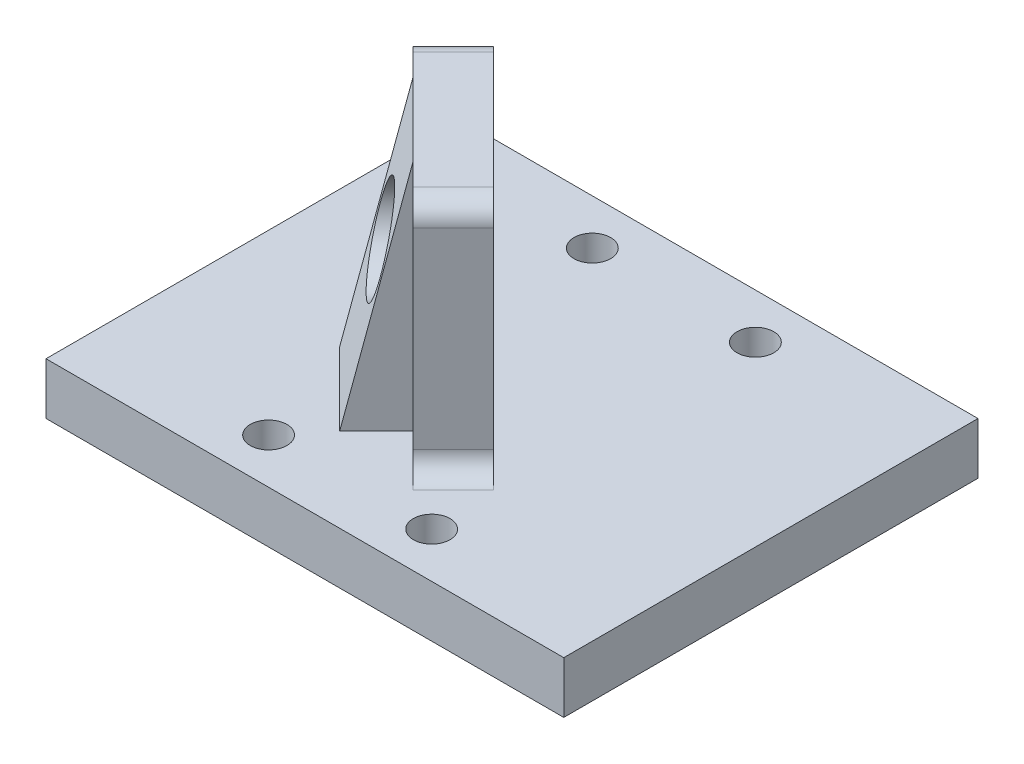
ISO-10303-21;
HEADER;
FILE_DESCRIPTION(('STEP AP214'),'2;1');
FILE_NAME('part.step','',(''),(''),'','','');
FILE_SCHEMA(('AUTOMOTIVE_DESIGN { 1 0 10303 214 1 1 1 1 }'));
ENDSEC;
DATA;
#1=APPLICATION_CONTEXT('core data for automotive mechanical design processes');
#2=APPLICATION_PROTOCOL_DEFINITION('international standard','automotive_design',2000,#1);
#3=PRODUCT_CONTEXT('',#1,'mechanical');
#4=PRODUCT('Part','Part','',(#3));
#5=PRODUCT_RELATED_PRODUCT_CATEGORY('part','',(#4));
#6=PRODUCT_DEFINITION_FORMATION('','',#4);
#7=PRODUCT_DEFINITION_CONTEXT('part definition',#1,'design');
#8=PRODUCT_DEFINITION('design','',#6,#7);
#9=PRODUCT_DEFINITION_SHAPE('','',#8);
#10=(LENGTH_UNIT() NAMED_UNIT(*) SI_UNIT(.MILLI.,.METRE.));
#11=(NAMED_UNIT(*) PLANE_ANGLE_UNIT() SI_UNIT($,.RADIAN.));
#12=(NAMED_UNIT(*) SI_UNIT($,.STERADIAN.) SOLID_ANGLE_UNIT());
#13=UNCERTAINTY_MEASURE_WITH_UNIT(LENGTH_MEASURE(1.E-05),#10,'distance_accuracy_value','');
#14=(GEOMETRIC_REPRESENTATION_CONTEXT(3) GLOBAL_UNCERTAINTY_ASSIGNED_CONTEXT((#13)) GLOBAL_UNIT_ASSIGNED_CONTEXT((#10,
#11,#12)) REPRESENTATION_CONTEXT('',''));
#15=CARTESIAN_POINT('',(0.,0.,0.));
#16=DIRECTION('',(0.,0.,1.));
#17=DIRECTION('',(1.,0.,0.));
#18=AXIS2_PLACEMENT_3D('',#15,#16,#17);
#19=CARTESIAN_POINT('',(2.90796857661204,34.925,15.0525436655256));
#20=DIRECTION('',(0.707106781186549,0.,-0.707106781186546));
#21=DIRECTION('',(-0.707106781186546,0.,-0.707106781186549));
#22=AXIS2_PLACEMENT_3D('',#19,#20,#21);
#23=PLANE('',#22);
#24=DIRECTION('',(0.,-1.,0.));
#25=VECTOR('',#24,1.);
#26=CARTESIAN_POINT('',(-1.58215948392223,6.35,10.5624156049914));
#27=LINE('',#26,#25);
#28=CARTESIAN_POINT('',(-1.58215948392223,34.925,10.5624156049914));
#29=VERTEX_POINT('',#28);
#30=CARTESIAN_POINT('',(-1.58215948392223,6.35,10.5624156049914));
#31=VERTEX_POINT('',#30);
#32=EDGE_CURVE('E52',#29,#31,#27,.T.);
#33=ORIENTED_EDGE('',*,*,#32,.T.);
#34=DIRECTION('',(0.707106781186546,0.,0.707106781186549));
#35=VECTOR('',#34,1.);
#36=CARTESIAN_POINT('',(2.90796857661204,6.35,15.0525436655256));
#37=LINE('',#36,#35);
#38=CARTESIAN_POINT('',(4.70401980082587,6.35,16.8485948897395));
#39=VERTEX_POINT('',#38);
#40=EDGE_CURVE('E171',#31,#39,#37,.T.);
#41=ORIENTED_EDGE('',*,*,#40,.T.);
#42=CARTESIAN_POINT('',(4.70401980082587,8.89,16.8485948897395));
#43=DIRECTION('',(0.707106781186549,0.,-0.707106781186546));
#44=DIRECTION('',(-0.707106781186546,0.,-0.707106781186549));
#45=AXIS2_PLACEMENT_3D('',#42,#43,#44);
#46=CIRCLE('',#45,2.54);
#47=CARTESIAN_POINT('',(2.90796857661204,8.89,15.0525436655256));
#48=VERTEX_POINT('',#47);
#49=EDGE_CURVE('E11',#39,#48,#46,.T.);
#50=ORIENTED_EDGE('',*,*,#49,.T.);
#51=DIRECTION('',(0.,-1.,0.));
#52=VECTOR('',#51,1.);
#53=CARTESIAN_POINT('',(2.90796857661204,34.925,15.0525436655256));
#54=LINE('',#53,#52);
#55=CARTESIAN_POINT('',(2.90796857661204,32.385,15.0525436655256));
#56=VERTEX_POINT('',#55);
#57=EDGE_CURVE('E180',#56,#48,#54,.T.);
#58=ORIENTED_EDGE('',*,*,#57,.F.);
#59=CARTESIAN_POINT('',(1.11191735239821,32.385,13.2564924413118));
#60=DIRECTION('',(0.707106781186549,0.,-0.707106781186546));
#61=DIRECTION('',(-0.707106781186546,0.,-0.707106781186549));
#62=AXIS2_PLACEMENT_3D('',#59,#60,#61);
#63=CIRCLE('',#62,2.54);
#64=CARTESIAN_POINT('',(1.11191735239821,34.925,13.2564924413118));
#65=VERTEX_POINT('',#64);
#66=EDGE_CURVE('E238',#56,#65,#63,.F.);
#67=ORIENTED_EDGE('',*,*,#66,.T.);
#68=DIRECTION('',(0.707106781186546,0.,0.707106781186549));
#69=VECTOR('',#68,1.);
#70=CARTESIAN_POINT('',(2.90796857661204,34.925,15.0525436655256));
#71=LINE('',#70,#69);
#72=EDGE_CURVE('E174',#29,#65,#71,.T.);
#73=ORIENTED_EDGE('',*,*,#72,.F.);
#74=EDGE_LOOP('',(#33,#41,#50,#58,#67,#73));
#75=FACE_BOUND('',#74,.T.);
#76=ADVANCED_FACE('F35',(#75),#23,.F.);
#77=CARTESIAN_POINT('',(0.,6.35,0.));
#78=DIRECTION('',(0.,-1.,0.));
#79=DIRECTION('',(0.,0.,-1.));
#80=AXIS2_PLACEMENT_3D('',#77,#78,#79);
#81=PLANE('',#80);
#82=CARTESIAN_POINT('',(-10.,6.35,19.85));
#83=DIRECTION('',(0.,1.,0.));
#84=DIRECTION('',(0.,0.,1.));
#85=AXIS2_PLACEMENT_3D('',#82,#83,#84);
#86=CIRCLE('',#85,2.25);
#87=CARTESIAN_POINT('',(-10.,6.35,22.1));
#88=VERTEX_POINT('',#87);
#89=EDGE_CURVE('E279',#88,#88,#86,.T.);
#90=ORIENTED_EDGE('',*,*,#89,.F.);
#91=EDGE_LOOP('',(#90));
#92=FACE_BOUND('',#91,.T.);
#93=CARTESIAN_POINT('',(-10.,6.35,-19.85));
#94=DIRECTION('',(0.,1.,0.));
#95=DIRECTION('',(0.,0.,1.));
#96=AXIS2_PLACEMENT_3D('',#93,#94,#95);
#97=CIRCLE('',#96,2.25);
#98=CARTESIAN_POINT('',(-10.,6.35,-17.6));
#99=VERTEX_POINT('',#98);
#100=EDGE_CURVE('E290',#99,#99,#97,.T.);
#101=ORIENTED_EDGE('',*,*,#100,.F.);
#102=EDGE_LOOP('',(#101));
#103=FACE_BOUND('',#102,.T.);
#104=CARTESIAN_POINT('',(10.,6.35,-19.85));
#105=DIRECTION('',(0.,1.,0.));
#106=DIRECTION('',(0.,0.,1.));
#107=AXIS2_PLACEMENT_3D('',#104,#105,#106);
#108=CIRCLE('',#107,2.25);
#109=CARTESIAN_POINT('',(10.,6.35,-17.6));
#110=VERTEX_POINT('',#109);
#111=EDGE_CURVE('E284',#110,#110,#108,.T.);
#112=ORIENTED_EDGE('',*,*,#111,.F.);
#113=EDGE_LOOP('',(#112));
#114=FACE_BOUND('',#113,.T.);
#115=CARTESIAN_POINT('',(10.,6.35,19.85));
#116=DIRECTION('',(0.,1.,0.));
#117=DIRECTION('',(0.,0.,1.));
#118=AXIS2_PLACEMENT_3D('',#115,#116,#117);
#119=CIRCLE('',#118,2.25);
#120=CARTESIAN_POINT('',(10.,6.35,22.1));
#121=VERTEX_POINT('',#120);
#122=EDGE_CURVE('E283',#121,#121,#119,.T.);
#123=ORIENTED_EDGE('',*,*,#122,.F.);
#124=EDGE_LOOP('',(#123));
#125=FACE_BOUND('',#124,.T.);
#126=DIRECTION('',(0.,0.,-1.));
#127=VECTOR('',#126,1.);
#128=CARTESIAN_POINT('',(31.75,6.35,25.4));
#129=LINE('',#128,#127);
#130=CARTESIAN_POINT('',(31.75,6.35,25.4));
#131=VERTEX_POINT('',#130);
#132=CARTESIAN_POINT('',(31.75,6.35,-25.4));
#133=VERTEX_POINT('',#132);
#134=EDGE_CURVE('E193',#131,#133,#129,.T.);
#135=ORIENTED_EDGE('',*,*,#134,.T.);
#136=DIRECTION('',(-1.,0.,0.));
#137=VECTOR('',#136,1.);
#138=CARTESIAN_POINT('',(-31.75,6.35,-25.4));
#139=LINE('',#138,#137);
#140=CARTESIAN_POINT('',(-31.75,6.35,-25.4));
#141=VERTEX_POINT('',#140);
#142=EDGE_CURVE('E196',#133,#141,#139,.T.);
#143=ORIENTED_EDGE('',*,*,#142,.T.);
#144=DIRECTION('',(0.,0.,1.));
#145=VECTOR('',#144,1.);
#146=CARTESIAN_POINT('',(-31.75,6.35,25.4));
#147=LINE('',#146,#145);
#148=CARTESIAN_POINT('',(-31.75,6.35,25.4));
#149=VERTEX_POINT('',#148);
#150=EDGE_CURVE('E199',#141,#149,#147,.T.);
#151=ORIENTED_EDGE('',*,*,#150,.T.);
#152=DIRECTION('',(1.,0.,0.));
#153=VECTOR('',#152,1.);
#154=CARTESIAN_POINT('',(-31.75,6.35,25.4));
#155=LINE('',#154,#153);
#156=EDGE_CURVE('E201',#149,#131,#155,.T.);
#157=ORIENTED_EDGE('',*,*,#156,.T.);
#158=EDGE_LOOP('',(#135,#143,#151,#157));
#159=FACE_BOUND('',#158,.T.);
#160=DIRECTION('',(0.707106781186546,0.,0.707106781186549));
#161=VECTOR('',#160,1.);
#162=CARTESIAN_POINT('',(-15.052543665526,6.35,6.07228754445675));
#163=LINE('',#162,#161);
#164=CARTESIAN_POINT('',(-15.052543665526,6.35,6.07228754445675));
#165=VERTEX_POINT('',#164);
#166=CARTESIAN_POINT('',(-6.07228754445681,6.35,15.0525436655259));
#167=VERTEX_POINT('',#166);
#168=EDGE_CURVE('E164',#165,#167,#163,.T.);
#169=ORIENTED_EDGE('',*,*,#168,.F.);
#170=DIRECTION('',(-0.707106781186549,0.,0.707106781186546));
#171=VECTOR('',#170,1.);
#172=CARTESIAN_POINT('',(-15.052543665526,6.35,6.07228754445675));
#173=LINE('',#172,#171);
#174=CARTESIAN_POINT('',(-10.5624156049914,6.35,1.58215948392218));
#175=VERTEX_POINT('',#174);
#176=EDGE_CURVE('E147',#175,#165,#173,.T.);
#177=ORIENTED_EDGE('',*,*,#176,.F.);
#178=CARTESIAN_POINT('',(-16.8485948897401,6.35,-4.70401980082653));
#179=VERTEX_POINT('',#178);
#180=EDGE_CURVE('E161',#179,#175,#37,.T.);
#181=ORIENTED_EDGE('',*,*,#180,.F.);
#182=DIRECTION('',(-0.707106781186549,0.,0.707106781186546));
#183=VECTOR('',#182,1.);
#184=CARTESIAN_POINT('',(-11.8988393604169,6.35,-9.65377533014966));
#185=LINE('',#184,#183);
#186=CARTESIAN_POINT('',(-11.8988393604169,6.35,-9.65377533014966));
#187=VERTEX_POINT('',#186);
#188=EDGE_CURVE('E230',#179,#187,#185,.F.);
#189=ORIENTED_EDGE('',*,*,#188,.T.);
#190=DIRECTION('',(-0.707106781186546,0.,-0.707106781186549));
#191=VECTOR('',#190,1.);
#192=CARTESIAN_POINT('',(7.85772410593518,6.35,10.1027881362025));
#193=LINE('',#192,#191);
#194=CARTESIAN_POINT('',(9.65377533014901,6.35,11.8988393604163));
#195=VERTEX_POINT('',#194);
#196=EDGE_CURVE('E176',#195,#187,#193,.T.);
#197=ORIENTED_EDGE('',*,*,#196,.F.);
#198=DIRECTION('',(0.707106781186549,0.,-0.707106781186546));
#199=VECTOR('',#198,1.);
#200=CARTESIAN_POINT('',(4.70401980082587,6.35,16.8485948897395));
#201=LINE('',#200,#199);
#202=EDGE_CURVE('E227',#195,#39,#201,.F.);
#203=ORIENTED_EDGE('',*,*,#202,.T.);
#204=ORIENTED_EDGE('',*,*,#40,.F.);
#205=DIRECTION('',(-0.707106781186549,0.,0.707106781186546));
#206=VECTOR('',#205,1.);
#207=CARTESIAN_POINT('',(-6.07228754445681,6.35,15.0525436655259));
#208=LINE('',#207,#206);
#209=EDGE_CURVE('E258',#31,#167,#208,.T.);
#210=ORIENTED_EDGE('',*,*,#209,.T.);
#211=EDGE_LOOP('',(#169,#177,#181,#189,#197,#203,#204,#210));
#212=FACE_BOUND('',#211,.T.);
#213=ADVANCED_FACE('F159',(#92,#103,#114,#125,#159,#212),#81,.F.);
#214=CARTESIAN_POINT('',(31.75,6.35,25.4));
#215=DIRECTION('',(-1.,0.,0.));
#216=DIRECTION('',(0.,0.,1.));
#217=AXIS2_PLACEMENT_3D('',#214,#215,#216);
#218=PLANE('',#217);
#219=DIRECTION('',(0.,0.,-1.));
#220=VECTOR('',#219,1.);
#221=CARTESIAN_POINT('',(31.75,0.,25.4));
#222=LINE('',#221,#220);
#223=CARTESIAN_POINT('',(31.75,0.,25.4));
#224=VERTEX_POINT('',#223);
#225=CARTESIAN_POINT('',(31.75,0.,-25.4));
#226=VERTEX_POINT('',#225);
#227=EDGE_CURVE('E192',#224,#226,#222,.T.);
#228=ORIENTED_EDGE('',*,*,#227,.T.);
#229=DIRECTION('',(0.,-1.,0.));
#230=VECTOR('',#229,1.);
#231=CARTESIAN_POINT('',(31.75,6.35,-25.4));
#232=LINE('',#231,#230);
#233=EDGE_CURVE('E219',#133,#226,#232,.T.);
#234=ORIENTED_EDGE('',*,*,#233,.F.);
#235=ORIENTED_EDGE('',*,*,#134,.F.);
#236=DIRECTION('',(0.,-1.,0.));
#237=VECTOR('',#236,1.);
#238=CARTESIAN_POINT('',(31.75,6.35,25.4));
#239=LINE('',#238,#237);
#240=EDGE_CURVE('E203',#131,#224,#239,.T.);
#241=ORIENTED_EDGE('',*,*,#240,.T.);
#242=EDGE_LOOP('',(#228,#234,#235,#241));
#243=FACE_BOUND('',#242,.T.);
#244=ADVANCED_FACE('F349',(#243),#218,.F.);
#245=CARTESIAN_POINT('',(-31.75,6.35,-25.4));
#246=DIRECTION('',(0.,0.,1.));
#247=DIRECTION('',(1.,0.,0.));
#248=AXIS2_PLACEMENT_3D('',#245,#246,#247);
#249=PLANE('',#248);
#250=DIRECTION('',(-1.,0.,0.));
#251=VECTOR('',#250,1.);
#252=CARTESIAN_POINT('',(-31.75,0.,-25.4));
#253=LINE('',#252,#251);
#254=CARTESIAN_POINT('',(-31.75,0.,-25.4));
#255=VERTEX_POINT('',#254);
#256=EDGE_CURVE('E206',#226,#255,#253,.T.);
#257=ORIENTED_EDGE('',*,*,#256,.T.);
#258=DIRECTION('',(0.,-1.,0.));
#259=VECTOR('',#258,1.);
#260=CARTESIAN_POINT('',(-31.75,6.35,-25.4));
#261=LINE('',#260,#259);
#262=EDGE_CURVE('E216',#141,#255,#261,.T.);
#263=ORIENTED_EDGE('',*,*,#262,.F.);
#264=ORIENTED_EDGE('',*,*,#142,.F.);
#265=ORIENTED_EDGE('',*,*,#233,.T.);
#266=EDGE_LOOP('',(#257,#263,#264,#265));
#267=FACE_BOUND('',#266,.T.);
#268=ADVANCED_FACE('F379',(#267),#249,.F.);
#269=CARTESIAN_POINT('',(-31.75,6.35,25.4));
#270=DIRECTION('',(1.,0.,0.));
#271=DIRECTION('',(0.,0.,-1.));
#272=AXIS2_PLACEMENT_3D('',#269,#270,#271);
#273=PLANE('',#272);
#274=DIRECTION('',(0.,0.,1.));
#275=VECTOR('',#274,1.);
#276=CARTESIAN_POINT('',(-31.75,0.,25.4));
#277=LINE('',#276,#275);
#278=CARTESIAN_POINT('',(-31.75,0.,25.4));
#279=VERTEX_POINT('',#278);
#280=EDGE_CURVE('E208',#255,#279,#277,.T.);
#281=ORIENTED_EDGE('',*,*,#280,.T.);
#282=DIRECTION('',(0.,-1.,0.));
#283=VECTOR('',#282,1.);
#284=CARTESIAN_POINT('',(-31.75,6.35,25.4));
#285=LINE('',#284,#283);
#286=EDGE_CURVE('E213',#149,#279,#285,.T.);
#287=ORIENTED_EDGE('',*,*,#286,.F.);
#288=ORIENTED_EDGE('',*,*,#150,.F.);
#289=ORIENTED_EDGE('',*,*,#262,.T.);
#290=EDGE_LOOP('',(#281,#287,#288,#289));
#291=FACE_BOUND('',#290,.T.);
#292=ADVANCED_FACE('F375',(#291),#273,.F.);
#293=CARTESIAN_POINT('',(-31.75,6.35,25.4));
#294=DIRECTION('',(0.,0.,-1.));
#295=DIRECTION('',(-1.,0.,0.));
#296=AXIS2_PLACEMENT_3D('',#293,#294,#295);
#297=PLANE('',#296);
#298=DIRECTION('',(1.,0.,0.));
#299=VECTOR('',#298,1.);
#300=CARTESIAN_POINT('',(-31.75,0.,25.4));
#301=LINE('',#300,#299);
#302=EDGE_CURVE('E197',#279,#224,#301,.T.);
#303=ORIENTED_EDGE('',*,*,#302,.T.);
#304=ORIENTED_EDGE('',*,*,#240,.F.);
#305=ORIENTED_EDGE('',*,*,#156,.F.);
#306=ORIENTED_EDGE('',*,*,#286,.T.);
#307=EDGE_LOOP('',(#303,#304,#305,#306));
#308=FACE_BOUND('',#307,.T.);
#309=ADVANCED_FACE('F371',(#308),#297,.F.);
#310=CARTESIAN_POINT('',(0.,0.,0.));
#311=DIRECTION('',(0.,-1.,0.));
#312=DIRECTION('',(0.,0.,-1.));
#313=AXIS2_PLACEMENT_3D('',#310,#311,#312);
#314=PLANE('',#313);
#315=CARTESIAN_POINT('',(-10.,0.,19.85));
#316=DIRECTION('',(0.,1.,0.));
#317=DIRECTION('',(0.,0.,1.));
#318=AXIS2_PLACEMENT_3D('',#315,#316,#317);
#319=CIRCLE('',#318,2.25);
#320=CARTESIAN_POINT('',(-10.,0.,22.1));
#321=VERTEX_POINT('',#320);
#322=EDGE_CURVE('E293',#321,#321,#319,.T.);
#323=ORIENTED_EDGE('',*,*,#322,.T.);
#324=EDGE_LOOP('',(#323));
#325=FACE_BOUND('',#324,.T.);
#326=CARTESIAN_POINT('',(-10.,0.,-19.85));
#327=DIRECTION('',(0.,1.,0.));
#328=DIRECTION('',(0.,0.,1.));
#329=AXIS2_PLACEMENT_3D('',#326,#327,#328);
#330=CIRCLE('',#329,2.25);
#331=CARTESIAN_POINT('',(-10.,0.,-17.6));
#332=VERTEX_POINT('',#331);
#333=EDGE_CURVE('E287',#332,#332,#330,.T.);
#334=ORIENTED_EDGE('',*,*,#333,.T.);
#335=EDGE_LOOP('',(#334));
#336=FACE_BOUND('',#335,.T.);
#337=CARTESIAN_POINT('',(10.,0.,-19.85));
#338=DIRECTION('',(0.,1.,0.));
#339=DIRECTION('',(0.,0.,1.));
#340=AXIS2_PLACEMENT_3D('',#337,#338,#339);
#341=CIRCLE('',#340,2.25);
#342=CARTESIAN_POINT('',(10.,0.,-17.6));
#343=VERTEX_POINT('',#342);
#344=EDGE_CURVE('E280',#343,#343,#341,.T.);
#345=ORIENTED_EDGE('',*,*,#344,.T.);
#346=EDGE_LOOP('',(#345));
#347=FACE_BOUND('',#346,.T.);
#348=CARTESIAN_POINT('',(10.,0.,19.85));
#349=DIRECTION('',(0.,1.,0.));
#350=DIRECTION('',(0.,0.,1.));
#351=AXIS2_PLACEMENT_3D('',#348,#349,#350);
#352=CIRCLE('',#351,2.25);
#353=CARTESIAN_POINT('',(10.,0.,22.1));
#354=VERTEX_POINT('',#353);
#355=EDGE_CURVE('E298',#354,#354,#352,.T.);
#356=ORIENTED_EDGE('',*,*,#355,.T.);
#357=EDGE_LOOP('',(#356));
#358=FACE_BOUND('',#357,.T.);
#359=ORIENTED_EDGE('',*,*,#227,.F.);
#360=ORIENTED_EDGE('',*,*,#302,.F.);
#361=ORIENTED_EDGE('',*,*,#280,.F.);
#362=ORIENTED_EDGE('',*,*,#256,.F.);
#363=EDGE_LOOP('',(#359,#360,#361,#362));
#364=FACE_BOUND('',#363,.T.);
#365=ADVANCED_FACE('F367',(#325,#336,#347,#358,#364),#314,.T.);
#366=CARTESIAN_POINT('',(2.90796857661204,34.925,15.0525436655256));
#367=DIRECTION('',(-0.707106781186546,0.,-0.707106781186549));
#368=DIRECTION('',(-0.707106781186549,0.,0.707106781186546));
#369=AXIS2_PLACEMENT_3D('',#366,#367,#368);
#370=PLANE('',#369);
#371=DIRECTION('',(0.,-1.,0.));
#372=VECTOR('',#371,1.);
#373=CARTESIAN_POINT('',(7.85772410593518,34.925,10.1027881362025));
#374=LINE('',#373,#372);
#375=CARTESIAN_POINT('',(7.85772410593518,32.385,10.1027881362025));
#376=VERTEX_POINT('',#375);
#377=CARTESIAN_POINT('',(7.85772410593518,8.89,10.1027881362025));
#378=VERTEX_POINT('',#377);
#379=EDGE_CURVE('E189',#376,#378,#374,.T.);
#380=ORIENTED_EDGE('',*,*,#379,.F.);
#381=DIRECTION('',(0.707106781186549,0.,-0.707106781186546));
#382=VECTOR('',#381,1.);
#383=CARTESIAN_POINT('',(2.90796857661204,32.385,15.0525436655256));
#384=LINE('',#383,#382);
#385=EDGE_CURVE('E249',#376,#56,#384,.F.);
#386=ORIENTED_EDGE('',*,*,#385,.T.);
#387=ORIENTED_EDGE('',*,*,#57,.T.);
#388=DIRECTION('',(0.707106781186549,0.,-0.707106781186546));
#389=VECTOR('',#388,1.);
#390=CARTESIAN_POINT('',(7.85772410593518,8.89,10.1027881362025));
#391=LINE('',#390,#389);
#392=EDGE_CURVE('E247',#48,#378,#391,.T.);
#393=ORIENTED_EDGE('',*,*,#392,.T.);
#394=EDGE_LOOP('',(#380,#386,#387,#393));
#395=FACE_BOUND('',#394,.T.);
#396=ADVANCED_FACE('F318',(#395),#370,.F.);
#397=CARTESIAN_POINT('',(7.85772410593518,34.925,10.1027881362025));
#398=DIRECTION('',(-0.707106781186549,0.,0.707106781186546));
#399=DIRECTION('',(0.707106781186546,0.,0.707106781186549));
#400=AXIS2_PLACEMENT_3D('',#397,#398,#399);
#401=PLANE('',#400);
#402=CARTESIAN_POINT('',(-1.12253201513365,22.225,1.12253201513365));
#403=DIRECTION('',(0.707106781186549,0.,-0.707106781186546));
#404=DIRECTION('',(-0.707106781186546,0.,-0.707106781186549));
#405=AXIS2_PLACEMENT_3D('',#402,#403,#404);
#406=CIRCLE('',#405,2.413);
#407=CARTESIAN_POINT('',(-2.82878067813679,22.225,-0.583716647869496));
#408=VERTEX_POINT('',#407);
#409=EDGE_CURVE('E276',#408,#408,#406,.T.);
#410=ORIENTED_EDGE('',*,*,#409,.F.);
#411=EDGE_LOOP('',(#410));
#412=FACE_BOUND('',#411,.T.);
#413=DIRECTION('',(0.,-1.,0.));
#414=VECTOR('',#413,1.);
#415=CARTESIAN_POINT('',(-10.1027881362031,34.925,-7.85772410593583));
#416=LINE('',#415,#414);
#417=CARTESIAN_POINT('',(-10.1027881362031,32.385,-7.85772410593583));
#418=VERTEX_POINT('',#417);
#419=CARTESIAN_POINT('',(-10.1027881362031,8.89,-7.85772410593583));
#420=VERTEX_POINT('',#419);
#421=EDGE_CURVE('E186',#418,#420,#416,.T.);
#422=ORIENTED_EDGE('',*,*,#421,.F.);
#423=CARTESIAN_POINT('',(-8.30673691198926,32.385,-6.06167288172199));
#424=DIRECTION('',(-0.707106781186549,0.,0.707106781186546));
#425=DIRECTION('',(0.707106781186546,0.,0.707106781186549));
#426=AXIS2_PLACEMENT_3D('',#423,#424,#425);
#427=CIRCLE('',#426,2.54);
#428=CARTESIAN_POINT('',(-8.30673691198926,34.925,-6.06167288172199));
#429=VERTEX_POINT('',#428);
#430=EDGE_CURVE('E245',#418,#429,#427,.F.);
#431=ORIENTED_EDGE('',*,*,#430,.T.);
#432=DIRECTION('',(-0.707106781186546,0.,-0.707106781186549));
#433=VECTOR('',#432,1.);
#434=CARTESIAN_POINT('',(7.85772410593518,34.925,10.1027881362025));
#435=LINE('',#434,#433);
#436=CARTESIAN_POINT('',(6.06167288172135,34.925,8.30673691198867));
#437=VERTEX_POINT('',#436);
#438=EDGE_CURVE('E170',#437,#429,#435,.T.);
#439=ORIENTED_EDGE('',*,*,#438,.F.);
#440=CARTESIAN_POINT('',(6.06167288172135,32.385,8.30673691198867));
#441=DIRECTION('',(-0.707106781186549,0.,0.707106781186546));
#442=DIRECTION('',(0.707106781186546,0.,0.707106781186549));
#443=AXIS2_PLACEMENT_3D('',#440,#441,#442);
#444=CIRCLE('',#443,2.54);
#445=EDGE_CURVE('E243',#437,#376,#444,.F.);
#446=ORIENTED_EDGE('',*,*,#445,.T.);
#447=ORIENTED_EDGE('',*,*,#379,.T.);
#448=CARTESIAN_POINT('',(9.65377533014901,8.89,11.8988393604163));
#449=DIRECTION('',(-0.707106781186549,0.,0.707106781186546));
#450=DIRECTION('',(0.707106781186546,0.,0.707106781186549));
#451=AXIS2_PLACEMENT_3D('',#448,#449,#450);
#452=CIRCLE('',#451,2.54);
#453=EDGE_CURVE('E44',#378,#195,#452,.T.);
#454=ORIENTED_EDGE('',*,*,#453,.T.);
#455=ORIENTED_EDGE('',*,*,#196,.T.);
#456=CARTESIAN_POINT('',(-11.8988393604169,8.89,-9.65377533014966));
#457=DIRECTION('',(-0.707106781186549,0.,0.707106781186546));
#458=DIRECTION('',(0.707106781186546,0.,0.707106781186549));
#459=AXIS2_PLACEMENT_3D('',#456,#457,#458);
#460=CIRCLE('',#459,2.54);
#461=EDGE_CURVE('E252',#187,#420,#460,.T.);
#462=ORIENTED_EDGE('',*,*,#461,.T.);
#463=EDGE_LOOP('',(#422,#431,#439,#446,#447,#454,#455,#462));
#464=FACE_BOUND('',#463,.T.);
#465=ADVANCED_FACE('F316',(#412,#464),#401,.F.);
#466=CARTESIAN_POINT('',(-15.0525436655262,34.925,-2.9079685766127));
#467=DIRECTION('',(0.707106781186546,0.,0.707106781186549));
#468=DIRECTION('',(0.707106781186549,0.,-0.707106781186546));
#469=AXIS2_PLACEMENT_3D('',#466,#467,#468);
#470=PLANE('',#469);
#471=ORIENTED_EDGE('',*,*,#421,.T.);
#472=DIRECTION('',(-0.707106781186549,0.,0.707106781186546));
#473=VECTOR('',#472,1.);
#474=CARTESIAN_POINT('',(-15.0525436655262,8.89,-2.9079685766127));
#475=LINE('',#474,#473);
#476=CARTESIAN_POINT('',(-15.0525436655262,8.89,-2.9079685766127));
#477=VERTEX_POINT('',#476);
#478=EDGE_CURVE('E224',#420,#477,#475,.T.);
#479=ORIENTED_EDGE('',*,*,#478,.T.);
#480=DIRECTION('',(0.,-1.,0.));
#481=VECTOR('',#480,1.);
#482=CARTESIAN_POINT('',(-15.0525436655262,34.925,-2.9079685766127));
#483=LINE('',#482,#481);
#484=CARTESIAN_POINT('',(-15.0525436655262,32.385,-2.9079685766127));
#485=VERTEX_POINT('',#484);
#486=EDGE_CURVE('E183',#485,#477,#483,.T.);
#487=ORIENTED_EDGE('',*,*,#486,.F.);
#488=DIRECTION('',(-0.707106781186549,0.,0.707106781186546));
#489=VECTOR('',#488,1.);
#490=CARTESIAN_POINT('',(-10.1027881362031,32.385,-7.85772410593583));
#491=LINE('',#490,#489);
#492=EDGE_CURVE('E222',#485,#418,#491,.F.);
#493=ORIENTED_EDGE('',*,*,#492,.T.);
#494=EDGE_LOOP('',(#471,#479,#487,#493));
#495=FACE_BOUND('',#494,.T.);
#496=ADVANCED_FACE('F326',(#495),#470,.F.);
#497=ORIENTED_EDGE('',*,*,#180,.T.);
#498=DIRECTION('',(0.,-1.,0.));
#499=VECTOR('',#498,1.);
#500=CARTESIAN_POINT('',(-10.5624156049914,6.35,1.58215948392218));
#501=LINE('',#500,#499);
#502=CARTESIAN_POINT('',(-10.5624156049914,34.925,1.58215948392218));
#503=VERTEX_POINT('',#502);
#504=EDGE_CURVE('E144',#503,#175,#501,.T.);
#505=ORIENTED_EDGE('',*,*,#504,.F.);
#506=CARTESIAN_POINT('',(-13.2564924413124,34.925,-1.11191735239887));
#507=VERTEX_POINT('',#506);
#508=EDGE_CURVE('E184',#507,#503,#71,.T.);
#509=ORIENTED_EDGE('',*,*,#508,.F.);
#510=CARTESIAN_POINT('',(-13.2564924413124,32.385,-1.11191735239887));
#511=DIRECTION('',(0.707106781186549,0.,-0.707106781186546));
#512=DIRECTION('',(-0.707106781186546,0.,-0.707106781186549));
#513=AXIS2_PLACEMENT_3D('',#510,#511,#512);
#514=CIRCLE('',#513,2.54);
#515=EDGE_CURVE('E241',#507,#485,#514,.F.);
#516=ORIENTED_EDGE('',*,*,#515,.T.);
#517=ORIENTED_EDGE('',*,*,#486,.T.);
#518=CARTESIAN_POINT('',(-16.8485948897401,8.89,-4.70401980082653));
#519=DIRECTION('',(0.707106781186549,0.,-0.707106781186546));
#520=DIRECTION('',(-0.707106781186546,0.,-0.707106781186549));
#521=AXIS2_PLACEMENT_3D('',#518,#519,#520);
#522=CIRCLE('',#521,2.54);
#523=EDGE_CURVE('E168',#477,#179,#522,.T.);
#524=ORIENTED_EDGE('',*,*,#523,.T.);
#525=EDGE_LOOP('',(#497,#505,#509,#516,#517,#524));
#526=FACE_BOUND('',#525,.T.);
#527=ADVANCED_FACE('F166',(#526),#23,.F.);
#528=CARTESIAN_POINT('',(0.,34.925,0.));
#529=DIRECTION('',(0.,1.,0.));
#530=DIRECTION('',(0.,0.,1.));
#531=AXIS2_PLACEMENT_3D('',#528,#529,#530);
#532=PLANE('',#531);
#533=ORIENTED_EDGE('',*,*,#438,.T.);
#534=DIRECTION('',(-0.707106781186549,0.,0.707106781186546));
#535=VECTOR('',#534,1.);
#536=CARTESIAN_POINT('',(-13.2564924413124,34.925,-1.11191735239886));
#537=LINE('',#536,#535);
#538=EDGE_CURVE('E235',#429,#507,#537,.T.);
#539=ORIENTED_EDGE('',*,*,#538,.T.);
#540=ORIENTED_EDGE('',*,*,#508,.T.);
#541=DIRECTION('',(0.707106781186546,0.,0.707106781186549));
#542=VECTOR('',#541,1.);
#543=CARTESIAN_POINT('',(-10.5624156049914,34.925,1.58215948392218));
#544=LINE('',#543,#542);
#545=EDGE_CURVE('E269',#503,#29,#544,.T.);
#546=ORIENTED_EDGE('',*,*,#545,.T.);
#547=ORIENTED_EDGE('',*,*,#72,.T.);
#548=DIRECTION('',(0.707106781186549,0.,-0.707106781186546));
#549=VECTOR('',#548,1.);
#550=CARTESIAN_POINT('',(6.06167288172135,34.925,8.30673691198867));
#551=LINE('',#550,#549);
#552=EDGE_CURVE('E232',#65,#437,#551,.T.);
#553=ORIENTED_EDGE('',*,*,#552,.T.);
#554=EDGE_LOOP('',(#533,#539,#540,#546,#547,#553));
#555=FACE_BOUND('',#554,.T.);
#556=ADVANCED_FACE('F304',(#555),#532,.T.);
#557=CARTESIAN_POINT('',(10.,0.,19.85));
#558=DIRECTION('',(0.,1.,0.));
#559=DIRECTION('',(0.,0.,1.));
#560=AXIS2_PLACEMENT_3D('',#557,#558,#559);
#561=CYLINDRICAL_SURFACE('',#560,2.25);
#562=ORIENTED_EDGE('',*,*,#355,.F.);
#563=EDGE_LOOP('',(#562));
#564=FACE_BOUND('',#563,.T.);
#565=ORIENTED_EDGE('',*,*,#122,.T.);
#566=EDGE_LOOP('',(#565));
#567=FACE_BOUND('',#566,.T.);
#568=ADVANCED_FACE('F359',(#564,#567),#561,.F.);
#569=CARTESIAN_POINT('',(10.,0.,-19.85));
#570=DIRECTION('',(0.,1.,0.));
#571=DIRECTION('',(0.,0.,1.));
#572=AXIS2_PLACEMENT_3D('',#569,#570,#571);
#573=CYLINDRICAL_SURFACE('',#572,2.25);
#574=ORIENTED_EDGE('',*,*,#344,.F.);
#575=EDGE_LOOP('',(#574));
#576=FACE_BOUND('',#575,.T.);
#577=ORIENTED_EDGE('',*,*,#111,.T.);
#578=EDGE_LOOP('',(#577));
#579=FACE_BOUND('',#578,.T.);
#580=ADVANCED_FACE('F514',(#576,#579),#573,.F.);
#581=CARTESIAN_POINT('',(-10.,0.,-19.85));
#582=DIRECTION('',(0.,1.,0.));
#583=DIRECTION('',(0.,0.,1.));
#584=AXIS2_PLACEMENT_3D('',#581,#582,#583);
#585=CYLINDRICAL_SURFACE('',#584,2.25);
#586=ORIENTED_EDGE('',*,*,#333,.F.);
#587=EDGE_LOOP('',(#586));
#588=FACE_BOUND('',#587,.T.);
#589=ORIENTED_EDGE('',*,*,#100,.T.);
#590=EDGE_LOOP('',(#589));
#591=FACE_BOUND('',#590,.T.);
#592=ADVANCED_FACE('F340',(#588,#591),#585,.F.);
#593=CARTESIAN_POINT('',(-10.,0.,19.85));
#594=DIRECTION('',(0.,1.,0.));
#595=DIRECTION('',(0.,0.,1.));
#596=AXIS2_PLACEMENT_3D('',#593,#594,#595);
#597=CYLINDRICAL_SURFACE('',#596,2.25);
#598=ORIENTED_EDGE('',*,*,#322,.F.);
#599=EDGE_LOOP('',(#598));
#600=FACE_BOUND('',#599,.T.);
#601=ORIENTED_EDGE('',*,*,#89,.T.);
#602=EDGE_LOOP('',(#601));
#603=FACE_BOUND('',#602,.T.);
#604=ADVANCED_FACE('F332',(#600,#603),#597,.F.);
#605=CARTESIAN_POINT('',(-16.8485948897401,8.89,-4.70401980082654));
#606=DIRECTION('',(0.707106781186549,0.,-0.707106781186546));
#607=DIRECTION('',(-0.707106781186546,0.,-0.707106781186549));
#608=AXIS2_PLACEMENT_3D('',#605,#606,#607);
#609=CYLINDRICAL_SURFACE('',#608,2.54);
#610=ORIENTED_EDGE('',*,*,#461,.F.);
#611=ORIENTED_EDGE('',*,*,#188,.F.);
#612=ORIENTED_EDGE('',*,*,#523,.F.);
#613=ORIENTED_EDGE('',*,*,#478,.F.);
#614=EDGE_LOOP('',(#610,#611,#612,#613));
#615=FACE_BOUND('',#614,.T.);
#616=ADVANCED_FACE('F329',(#615),#609,.F.);
#617=CARTESIAN_POINT('',(-7.18420489685561,32.385,-7.18420489685564));
#618=DIRECTION('',(0.707106781186549,0.,-0.707106781186546));
#619=DIRECTION('',(-0.707106781186546,0.,-0.707106781186549));
#620=AXIS2_PLACEMENT_3D('',#617,#618,#619);
#621=CYLINDRICAL_SURFACE('',#620,2.54);
#622=ORIENTED_EDGE('',*,*,#430,.F.);
#623=ORIENTED_EDGE('',*,*,#492,.F.);
#624=ORIENTED_EDGE('',*,*,#515,.F.);
#625=ORIENTED_EDGE('',*,*,#538,.F.);
#626=EDGE_LOOP('',(#622,#623,#624,#625));
#627=FACE_BOUND('',#626,.T.);
#628=ADVANCED_FACE('F331',(#627),#621,.T.);
#629=CARTESIAN_POINT('',(7.184204896855,32.385,7.18420489685503));
#630=DIRECTION('',(-0.707106781186549,0.,0.707106781186546));
#631=DIRECTION('',(0.707106781186546,0.,0.707106781186549));
#632=AXIS2_PLACEMENT_3D('',#629,#630,#631);
#633=CYLINDRICAL_SURFACE('',#632,2.54);
#634=ORIENTED_EDGE('',*,*,#66,.F.);
#635=ORIENTED_EDGE('',*,*,#385,.F.);
#636=ORIENTED_EDGE('',*,*,#445,.F.);
#637=ORIENTED_EDGE('',*,*,#552,.F.);
#638=EDGE_LOOP('',(#634,#635,#636,#637));
#639=FACE_BOUND('',#638,.T.);
#640=ADVANCED_FACE('F312',(#639),#633,.T.);
#641=CARTESIAN_POINT('',(4.70401980082587,8.89,16.8485948897395));
#642=DIRECTION('',(-0.707106781186549,0.,0.707106781186546));
#643=DIRECTION('',(0.707106781186546,0.,0.707106781186549));
#644=AXIS2_PLACEMENT_3D('',#641,#642,#643);
#645=CYLINDRICAL_SURFACE('',#644,2.54);
#646=ORIENTED_EDGE('',*,*,#49,.F.);
#647=ORIENTED_EDGE('',*,*,#202,.F.);
#648=ORIENTED_EDGE('',*,*,#453,.F.);
#649=ORIENTED_EDGE('',*,*,#392,.F.);
#650=EDGE_LOOP('',(#646,#647,#648,#649));
#651=FACE_BOUND('',#650,.T.);
#652=ADVANCED_FACE('F37',(#651),#645,.F.);
#653=CARTESIAN_POINT('',(-28.575,22.225,28.5749999999999));
#654=DIRECTION('',(0.707106781186549,0.,-0.707106781186546));
#655=DIRECTION('',(-0.707106781186546,0.,-0.707106781186549));
#656=AXIS2_PLACEMENT_3D('',#653,#654,#655);
#657=CYLINDRICAL_SURFACE('',#656,2.413);
#658=ORIENTED_EDGE('',*,*,#409,.T.);
#659=EDGE_LOOP('',(#658));
#660=FACE_BOUND('',#659,.T.);
#661=CARTESIAN_POINT('',(-6.07228754445679,22.225,6.07228754445677));
#662=DIRECTION('',(0.707106781186549,0.,-0.707106781186546));
#663=DIRECTION('',(-0.707106781186546,0.,-0.707106781186549));
#664=AXIS2_PLACEMENT_3D('',#661,#662,#663);
#665=CIRCLE('',#664,2.413);
#666=CARTESIAN_POINT('',(-7.77853620745993,22.225,4.36603888145363));
#667=VERTEX_POINT('',#666);
#668=EDGE_CURVE('E254',#667,#667,#665,.T.);
#669=ORIENTED_EDGE('',*,*,#668,.F.);
#670=EDGE_LOOP('',(#669));
#671=FACE_BOUND('',#670,.T.);
#672=ADVANCED_FACE('F438',(#660,#671),#657,.F.);
#673=CARTESIAN_POINT('',(-10.5624156049914,34.925,1.58215948392218));
#674=DIRECTION('',(0.690268489962635,-0.216930457818656,-0.690268489962632));
#675=DIRECTION('',(-0.707106781186546,0.,-0.707106781186549));
#676=AXIS2_PLACEMENT_3D('',#673,#674,#675);
#677=PLANE('',#676);
#678=CARTESIAN_POINT('',(-8.0679000158055,22.225,8.06790001580547));
#679=DIRECTION('',(0.690268489962635,-0.216930457818656,-0.690268489962632));
#680=DIRECTION('',(0.153392997769473,0.976187060183953,-0.153392997769475));
#681=AXIS2_PLACEMENT_3D('',#678,#679,#680);
#682=ELLIPSE('',#681,5.72431271415029,5.588);
#683=CARTESIAN_POINT('',(-7.18983052841208,27.813,7.18983052841204));
#684=VERTEX_POINT('',#683);
#685=EDGE_CURVE('E39',#684,#684,#682,.F.);
#686=ORIENTED_EDGE('',*,*,#685,.F.);
#687=EDGE_LOOP('',(#686));
#688=FACE_BOUND('',#687,.T.);
#689=DIRECTION('',(0.153392997769474,0.976187060183953,-0.153392997769474));
#690=VECTOR('',#689,1.);
#691=CARTESIAN_POINT('',(-1.58215948392223,34.925,10.5624156049914));
#692=LINE('',#691,#690);
#693=EDGE_CURVE('E155',#167,#29,#692,.T.);
#694=ORIENTED_EDGE('',*,*,#693,.T.);
#695=ORIENTED_EDGE('',*,*,#545,.F.);
#696=DIRECTION('',(0.153392997769474,0.976187060183953,-0.153392997769474));
#697=VECTOR('',#696,1.);
#698=CARTESIAN_POINT('',(-10.5624156049914,34.925,1.58215948392218));
#699=LINE('',#698,#697);
#700=EDGE_CURVE('E149',#165,#503,#699,.T.);
#701=ORIENTED_EDGE('',*,*,#700,.F.);
#702=ORIENTED_EDGE('',*,*,#168,.T.);
#703=EDGE_LOOP('',(#694,#695,#701,#702));
#704=FACE_BOUND('',#703,.T.);
#705=ADVANCED_FACE('F442',(#688,#704),#677,.F.);
#706=CARTESIAN_POINT('',(-4.49012806053457,0.,-4.49012806053459));
#707=DIRECTION('',(-0.707106781186546,0.,-0.707106781186549));
#708=DIRECTION('',(-0.707106781186549,0.,0.707106781186546));
#709=AXIS2_PLACEMENT_3D('',#706,#707,#708);
#710=PLANE('',#709);
#711=ORIENTED_EDGE('',*,*,#504,.T.);
#712=ORIENTED_EDGE('',*,*,#176,.T.);
#713=ORIENTED_EDGE('',*,*,#700,.T.);
#714=EDGE_LOOP('',(#711,#712,#713));
#715=FACE_BOUND('',#714,.T.);
#716=ADVANCED_FACE('F146',(#715),#710,.T.);
#717=CARTESIAN_POINT('',(4.49012806053457,0.,4.49012806053459));
#718=DIRECTION('',(-0.707106781186546,0.,-0.707106781186549));
#719=DIRECTION('',(-0.707106781186549,0.,0.707106781186546));
#720=AXIS2_PLACEMENT_3D('',#717,#718,#719);
#721=PLANE('',#720);
#722=ORIENTED_EDGE('',*,*,#32,.F.);
#723=ORIENTED_EDGE('',*,*,#693,.F.);
#724=ORIENTED_EDGE('',*,*,#209,.F.);
#725=EDGE_LOOP('',(#722,#723,#724));
#726=FACE_BOUND('',#725,.T.);
#727=ADVANCED_FACE('F475',(#726),#721,.F.);
#728=CARTESIAN_POINT('',(-6.07228754445679,22.225,6.07228754445677));
#729=DIRECTION('',(-0.707106781186549,0.,0.707106781186546));
#730=DIRECTION('',(0.707106781186546,0.,0.707106781186549));
#731=AXIS2_PLACEMENT_3D('',#728,#729,#730);
#732=PLANE('',#731);
#733=CARTESIAN_POINT('',(-6.07228754445679,22.225,6.07228754445677));
#734=DIRECTION('',(-0.707106781186549,0.,0.707106781186546));
#735=DIRECTION('',(0.707106781186546,0.,0.707106781186549));
#736=AXIS2_PLACEMENT_3D('',#733,#734,#735);
#737=CIRCLE('',#736,5.588);
#738=CARTESIAN_POINT('',(-2.12097485118638,22.225,10.0236002377272));
#739=VERTEX_POINT('',#738);
#740=EDGE_CURVE('E261',#739,#739,#737,.T.);
#741=ORIENTED_EDGE('',*,*,#740,.T.);
#742=EDGE_LOOP('',(#741));
#743=FACE_BOUND('',#742,.T.);
#744=ORIENTED_EDGE('',*,*,#668,.T.);
#745=EDGE_LOOP('',(#744));
#746=FACE_BOUND('',#745,.T.);
#747=ADVANCED_FACE('F484',(#743,#746),#732,.T.);
#748=CARTESIAN_POINT('',(-28.5750000000001,22.225,28.575));
#749=DIRECTION('',(0.707106781186549,0.,-0.707106781186546));
#750=DIRECTION('',(-0.707106781186546,0.,-0.707106781186549));
#751=AXIS2_PLACEMENT_3D('',#748,#749,#750);
#752=CYLINDRICAL_SURFACE('',#751,5.588);
#753=ORIENTED_EDGE('',*,*,#740,.F.);
#754=EDGE_LOOP('',(#753));
#755=FACE_BOUND('',#754,.T.);
#756=ORIENTED_EDGE('',*,*,#685,.T.);
#757=EDGE_LOOP('',(#756));
#758=FACE_BOUND('',#757,.T.);
#759=ADVANCED_FACE('F500',(#755,#758),#752,.F.);
#760=CLOSED_SHELL('',(#76,#213,#244,#268,#292,#309,#365,#396,#465,#496,#527,#556,#568,#580,#592,
#604,#616,#628,#640,#652,#672,#705,#716,#727,#747,#759));
#761=MANIFOLD_SOLID_BREP('B2',#760);
#762=ADVANCED_BREP_SHAPE_REPRESENTATION('',(#18,#761),#14);
#763=SHAPE_DEFINITION_REPRESENTATION(#9,#762);
ENDSEC;
END-ISO-10303-21;
